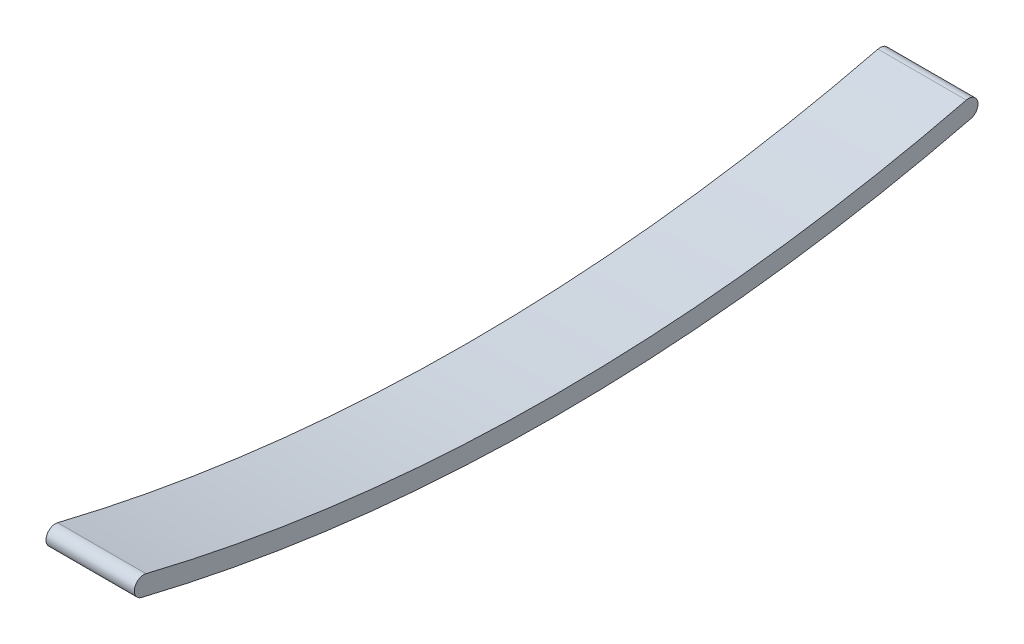
ISO-10303-21;
HEADER;
FILE_DESCRIPTION(('STEP AP214'),'2;1');
FILE_NAME('part.step','',(''),(''),'','','');
FILE_SCHEMA(('AUTOMOTIVE_DESIGN { 1 0 10303 214 1 1 1 1 }'));
ENDSEC;
DATA;
#1=APPLICATION_CONTEXT('core data for automotive mechanical design processes');
#2=APPLICATION_PROTOCOL_DEFINITION('international standard','automotive_design',2000,#1);
#3=PRODUCT_CONTEXT('',#1,'mechanical');
#4=PRODUCT('Part','Part','',(#3));
#5=PRODUCT_RELATED_PRODUCT_CATEGORY('part','',(#4));
#6=PRODUCT_DEFINITION_FORMATION('','',#4);
#7=PRODUCT_DEFINITION_CONTEXT('part definition',#1,'design');
#8=PRODUCT_DEFINITION('design','',#6,#7);
#9=PRODUCT_DEFINITION_SHAPE('','',#8);
#10=(LENGTH_UNIT() NAMED_UNIT(*) SI_UNIT(.MILLI.,.METRE.));
#11=(NAMED_UNIT(*) PLANE_ANGLE_UNIT() SI_UNIT($,.RADIAN.));
#12=(NAMED_UNIT(*) SI_UNIT($,.STERADIAN.) SOLID_ANGLE_UNIT());
#13=UNCERTAINTY_MEASURE_WITH_UNIT(LENGTH_MEASURE(1.E-05),#10,'distance_accuracy_value','');
#14=(GEOMETRIC_REPRESENTATION_CONTEXT(3) GLOBAL_UNCERTAINTY_ASSIGNED_CONTEXT((#13)) GLOBAL_UNIT_ASSIGNED_CONTEXT((#10,
#11,#12)) REPRESENTATION_CONTEXT('',''));
#15=CARTESIAN_POINT('',(0.,0.,0.));
#16=DIRECTION('',(0.,0.,1.));
#17=DIRECTION('',(1.,0.,0.));
#18=AXIS2_PLACEMENT_3D('',#15,#16,#17);
#19=CARTESIAN_POINT('',(7.,-4.80454146693236,32.6785013730875));
#20=DIRECTION('',(-1.,0.,0.));
#21=DIRECTION('',(0.,0.,1.));
#22=AXIS2_PLACEMENT_3D('',#19,#20,#21);
#23=CYLINDRICAL_SURFACE('',#22,0.750000000000011);
#24=CARTESIAN_POINT('',(0.,-4.80454146693236,32.6785013730875));
#25=DIRECTION('',(1.,0.,0.));
#26=DIRECTION('',(0.,0.,-1.));
#27=AXIS2_PLACEMENT_3D('',#24,#25,#26);
#28=CIRCLE('',#27,0.750000000000011);
#29=CARTESIAN_POINT('',(0.,-4.07609293765532,32.5));
#30=VERTEX_POINT('',#29);
#31=CARTESIAN_POINT('',(0.,-5.53298999620941,32.857002746175));
#32=VERTEX_POINT('',#31);
#33=EDGE_CURVE('E96',#30,#32,#28,.T.);
#34=ORIENTED_EDGE('',*,*,#33,.T.);
#35=DIRECTION('',(-1.,0.,0.));
#36=VECTOR('',#35,1.);
#37=CARTESIAN_POINT('',(7.,-5.53298999620941,32.857002746175));
#38=LINE('',#37,#36);
#39=CARTESIAN_POINT('',(7.,-5.53298999620941,32.857002746175));
#40=VERTEX_POINT('',#39);
#41=EDGE_CURVE('E11',#40,#32,#38,.T.);
#42=ORIENTED_EDGE('',*,*,#41,.F.);
#43=CARTESIAN_POINT('',(7.,-4.80454146693236,32.6785013730875));
#44=DIRECTION('',(1.,0.,0.));
#45=DIRECTION('',(0.,0.,-1.));
#46=AXIS2_PLACEMENT_3D('',#43,#44,#45);
#47=CIRCLE('',#46,0.750000000000011);
#48=CARTESIAN_POINT('',(7.,-4.07609293765532,32.5));
#49=VERTEX_POINT('',#48);
#50=EDGE_CURVE('E84',#49,#40,#47,.T.);
#51=ORIENTED_EDGE('',*,*,#50,.F.);
#52=DIRECTION('',(-1.,0.,0.));
#53=VECTOR('',#52,1.);
#54=CARTESIAN_POINT('',(7.,-4.07609293765532,32.5));
#55=LINE('',#54,#53);
#56=EDGE_CURVE('E92',#49,#30,#55,.T.);
#57=ORIENTED_EDGE('',*,*,#56,.T.);
#58=EDGE_LOOP('',(#34,#42,#51,#57));
#59=FACE_BOUND('',#58,.T.);
#60=ADVANCED_FACE('F33',(#59),#23,.T.);
#61=CARTESIAN_POINT('',(7.,128.553571428571,0.));
#62=DIRECTION('',(-1.,0.,0.));
#63=DIRECTION('',(0.,0.,1.));
#64=AXIS2_PLACEMENT_3D('',#61,#62,#63);
#65=CYLINDRICAL_SURFACE('',#64,138.053571428571);
#66=CARTESIAN_POINT('',(0.,128.553571428571,0.));
#67=DIRECTION('',(1.,0.,0.));
#68=DIRECTION('',(0.,0.,-1.));
#69=AXIS2_PLACEMENT_3D('',#66,#67,#68);
#70=CIRCLE('',#69,138.053571428571);
#71=CARTESIAN_POINT('',(0.,-5.53298999620941,-32.857002746175));
#72=VERTEX_POINT('',#71);
#73=EDGE_CURVE('E88',#32,#72,#70,.T.);
#74=ORIENTED_EDGE('',*,*,#73,.T.);
#75=DIRECTION('',(-1.,0.,0.));
#76=VECTOR('',#75,1.);
#77=CARTESIAN_POINT('',(7.,-5.53298999620941,-32.857002746175));
#78=LINE('',#77,#76);
#79=CARTESIAN_POINT('',(7.,-5.53298999620941,-32.857002746175));
#80=VERTEX_POINT('',#79);
#81=EDGE_CURVE('E41',#80,#72,#78,.T.);
#82=ORIENTED_EDGE('',*,*,#81,.F.);
#83=CARTESIAN_POINT('',(7.,128.553571428571,0.));
#84=DIRECTION('',(1.,0.,0.));
#85=DIRECTION('',(0.,0.,-1.));
#86=AXIS2_PLACEMENT_3D('',#83,#84,#85);
#87=CIRCLE('',#86,138.053571428571);
#88=EDGE_CURVE('E79',#40,#80,#87,.T.);
#89=ORIENTED_EDGE('',*,*,#88,.F.);
#90=ORIENTED_EDGE('',*,*,#41,.T.);
#91=EDGE_LOOP('',(#74,#82,#89,#90));
#92=FACE_BOUND('',#91,.T.);
#93=ADVANCED_FACE('F87',(#92),#65,.T.);
#94=CARTESIAN_POINT('',(7.,-4.80454146693238,-32.6785013730875));
#95=DIRECTION('',(-1.,0.,0.));
#96=DIRECTION('',(0.,0.,1.));
#97=AXIS2_PLACEMENT_3D('',#94,#95,#96);
#98=CYLINDRICAL_SURFACE('',#97,0.749999999999994);
#99=CARTESIAN_POINT('',(0.,-4.80454146693238,-32.6785013730875));
#100=DIRECTION('',(1.,0.,0.));
#101=DIRECTION('',(0.,0.,1.));
#102=AXIS2_PLACEMENT_3D('',#99,#100,#101);
#103=CIRCLE('',#102,0.749999999999994);
#104=CARTESIAN_POINT('',(0.,-4.07609293765535,-32.5));
#105=VERTEX_POINT('',#104);
#106=EDGE_CURVE('E66',#72,#105,#103,.T.);
#107=ORIENTED_EDGE('',*,*,#106,.T.);
#108=DIRECTION('',(-1.,0.,0.));
#109=VECTOR('',#108,1.);
#110=CARTESIAN_POINT('',(7.,-4.07609293765535,-32.5));
#111=LINE('',#110,#109);
#112=CARTESIAN_POINT('',(7.,-4.07609293765535,-32.5));
#113=VERTEX_POINT('',#112);
#114=EDGE_CURVE('E89',#113,#105,#111,.T.);
#115=ORIENTED_EDGE('',*,*,#114,.F.);
#116=CARTESIAN_POINT('',(7.,-4.80454146693238,-32.6785013730875));
#117=DIRECTION('',(1.,0.,0.));
#118=DIRECTION('',(0.,0.,1.));
#119=AXIS2_PLACEMENT_3D('',#116,#117,#118);
#120=CIRCLE('',#119,0.749999999999994);
#121=EDGE_CURVE('E82',#80,#113,#120,.T.);
#122=ORIENTED_EDGE('',*,*,#121,.F.);
#123=ORIENTED_EDGE('',*,*,#81,.T.);
#124=EDGE_LOOP('',(#107,#115,#122,#123));
#125=FACE_BOUND('',#124,.T.);
#126=ADVANCED_FACE('F90',(#125),#98,.T.);
#127=CARTESIAN_POINT('',(7.,128.553571428571,0.));
#128=DIRECTION('',(-1.,0.,0.));
#129=DIRECTION('',(0.,0.,1.));
#130=AXIS2_PLACEMENT_3D('',#127,#128,#129);
#131=CYLINDRICAL_SURFACE('',#130,136.553571428571);
#132=CARTESIAN_POINT('',(0.,128.553571428571,0.));
#133=DIRECTION('',(-1.,0.,0.));
#134=DIRECTION('',(0.,0.,-1.));
#135=AXIS2_PLACEMENT_3D('',#132,#133,#134);
#136=CIRCLE('',#135,136.553571428571);
#137=EDGE_CURVE('E72',#105,#30,#136,.T.);
#138=ORIENTED_EDGE('',*,*,#137,.T.);
#139=ORIENTED_EDGE('',*,*,#56,.F.);
#140=CARTESIAN_POINT('',(7.,128.553571428571,0.));
#141=DIRECTION('',(-1.,0.,0.));
#142=DIRECTION('',(0.,0.,-1.));
#143=AXIS2_PLACEMENT_3D('',#140,#141,#142);
#144=CIRCLE('',#143,136.553571428571);
#145=EDGE_CURVE('E49',#113,#49,#144,.T.);
#146=ORIENTED_EDGE('',*,*,#145,.F.);
#147=ORIENTED_EDGE('',*,*,#114,.T.);
#148=EDGE_LOOP('',(#138,#139,#146,#147));
#149=FACE_BOUND('',#148,.T.);
#150=ADVANCED_FACE('F103',(#149),#131,.F.);
#151=CARTESIAN_POINT('',(7.,61.8745149808195,16.3392506865438));
#152=DIRECTION('',(1.,0.,0.));
#153=DIRECTION('',(0.,0.,-1.));
#154=AXIS2_PLACEMENT_3D('',#151,#152,#153);
#155=PLANE('',#154);
#156=ORIENTED_EDGE('',*,*,#50,.T.);
#157=ORIENTED_EDGE('',*,*,#88,.T.);
#158=ORIENTED_EDGE('',*,*,#121,.T.);
#159=ORIENTED_EDGE('',*,*,#145,.T.);
#160=EDGE_LOOP('',(#156,#157,#158,#159));
#161=FACE_BOUND('',#160,.T.);
#162=ADVANCED_FACE('F80',(#161),#155,.T.);
#163=CARTESIAN_POINT('',(0.,61.8745149808195,16.3392506865438));
#164=DIRECTION('',(1.,0.,0.));
#165=DIRECTION('',(0.,0.,-1.));
#166=AXIS2_PLACEMENT_3D('',#163,#164,#165);
#167=PLANE('',#166);
#168=ORIENTED_EDGE('',*,*,#33,.F.);
#169=ORIENTED_EDGE('',*,*,#137,.F.);
#170=ORIENTED_EDGE('',*,*,#106,.F.);
#171=ORIENTED_EDGE('',*,*,#73,.F.);
#172=EDGE_LOOP('',(#168,#169,#170,#171));
#173=FACE_BOUND('',#172,.T.);
#174=ADVANCED_FACE('F106',(#173),#167,.F.);
#175=CLOSED_SHELL('',(#60,#93,#126,#150,#162,#174));
#176=MANIFOLD_SOLID_BREP('B2',#175);
#177=ADVANCED_BREP_SHAPE_REPRESENTATION('',(#18,#176),#14);
#178=SHAPE_DEFINITION_REPRESENTATION(#9,#177);
ENDSEC;
END-ISO-10303-21;
